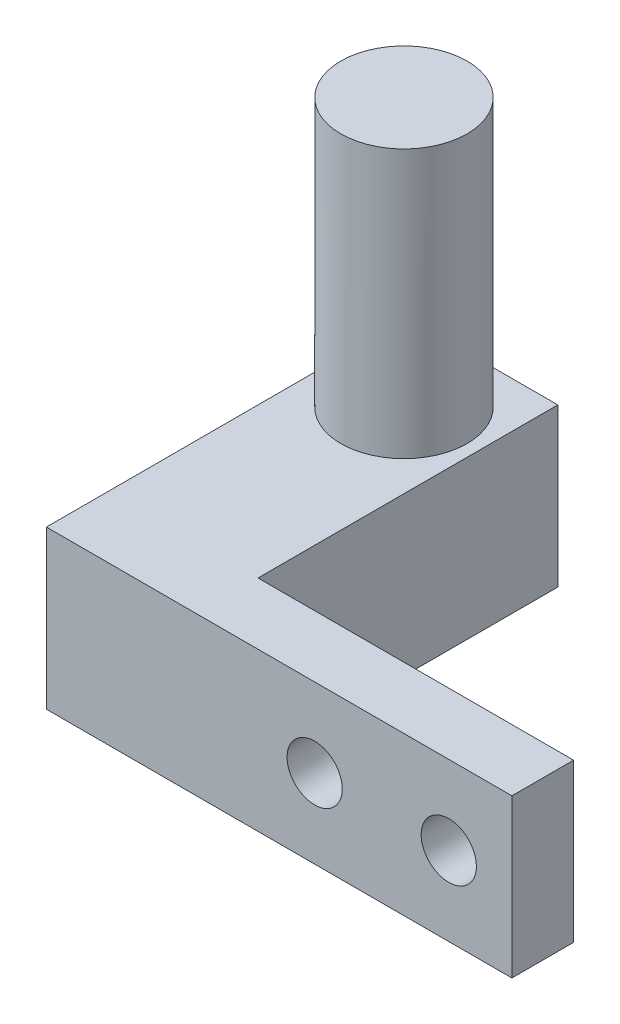
ISO-10303-21;
HEADER;
FILE_DESCRIPTION(('STEP AP214'),'2;1');
FILE_NAME('part.step','',(''),(''),'','','');
FILE_SCHEMA(('AUTOMOTIVE_DESIGN { 1 0 10303 214 1 1 1 1 }'));
ENDSEC;
DATA;
#1=APPLICATION_CONTEXT('core data for automotive mechanical design processes');
#2=APPLICATION_PROTOCOL_DEFINITION('international standard','automotive_design',2000,#1);
#3=PRODUCT_CONTEXT('',#1,'mechanical');
#4=PRODUCT('Part','Part','',(#3));
#5=PRODUCT_RELATED_PRODUCT_CATEGORY('part','',(#4));
#6=PRODUCT_DEFINITION_FORMATION('','',#4);
#7=PRODUCT_DEFINITION_CONTEXT('part definition',#1,'design');
#8=PRODUCT_DEFINITION('design','',#6,#7);
#9=PRODUCT_DEFINITION_SHAPE('','',#8);
#10=(LENGTH_UNIT() NAMED_UNIT(*) SI_UNIT(.MILLI.,.METRE.));
#11=(NAMED_UNIT(*) PLANE_ANGLE_UNIT() SI_UNIT($,.RADIAN.));
#12=(NAMED_UNIT(*) SI_UNIT($,.STERADIAN.) SOLID_ANGLE_UNIT());
#13=UNCERTAINTY_MEASURE_WITH_UNIT(LENGTH_MEASURE(1.E-05),#10,'distance_accuracy_value','');
#14=(GEOMETRIC_REPRESENTATION_CONTEXT(3) GLOBAL_UNCERTAINTY_ASSIGNED_CONTEXT((#13)) GLOBAL_UNIT_ASSIGNED_CONTEXT((#10,
#11,#12)) REPRESENTATION_CONTEXT('',''));
#15=CARTESIAN_POINT('',(0.,0.,0.));
#16=DIRECTION('',(0.,0.,1.));
#17=DIRECTION('',(1.,0.,0.));
#18=AXIS2_PLACEMENT_3D('',#15,#16,#17);
#19=CARTESIAN_POINT('',(8.5,0.,0.));
#20=DIRECTION('',(-1.,0.,0.));
#21=DIRECTION('',(0.,0.,1.));
#22=AXIS2_PLACEMENT_3D('',#19,#20,#21);
#23=PLANE('',#22);
#24=DIRECTION('',(0.,0.,1.));
#25=VECTOR('',#24,1.);
#26=CARTESIAN_POINT('',(8.5,10.,0.));
#27=LINE('',#26,#25);
#28=CARTESIAN_POINT('',(8.5,10.,0.));
#29=VERTEX_POINT('',#28);
#30=CARTESIAN_POINT('',(8.5,10.,19.));
#31=VERTEX_POINT('',#30);
#32=EDGE_CURVE('E126',#29,#31,#27,.T.);
#33=ORIENTED_EDGE('',*,*,#32,.T.);
#34=DIRECTION('',(0.,-1.,0.));
#35=VECTOR('',#34,1.);
#36=CARTESIAN_POINT('',(8.5,27.,19.));
#37=LINE('',#36,#35);
#38=CARTESIAN_POINT('',(8.5,0.,19.));
#39=VERTEX_POINT('',#38);
#40=EDGE_CURVE('E101',#31,#39,#37,.T.);
#41=ORIENTED_EDGE('',*,*,#40,.T.);
#42=DIRECTION('',(0.,0.,1.));
#43=VECTOR('',#42,1.);
#44=CARTESIAN_POINT('',(8.5,0.,0.));
#45=LINE('',#44,#43);
#46=CARTESIAN_POINT('',(8.5,0.,0.));
#47=VERTEX_POINT('',#46);
#48=EDGE_CURVE('E99',#47,#39,#45,.T.);
#49=ORIENTED_EDGE('',*,*,#48,.F.);
#50=DIRECTION('',(0.,1.,0.));
#51=VECTOR('',#50,1.);
#52=CARTESIAN_POINT('',(8.5,0.,0.));
#53=LINE('',#52,#51);
#54=EDGE_CURVE('E128',#47,#29,#53,.T.);
#55=ORIENTED_EDGE('',*,*,#54,.T.);
#56=EDGE_LOOP('',(#33,#41,#49,#55));
#57=FACE_BOUND('',#56,.T.);
#58=ADVANCED_FACE('F33',(#57),#23,.F.);
#59=CARTESIAN_POINT('',(0.,0.,10.));
#60=DIRECTION('',(0.,1.,0.));
#61=DIRECTION('',(0.,0.,1.));
#62=AXIS2_PLACEMENT_3D('',#59,#60,#61);
#63=PLANE('',#62);
#64=ORIENTED_EDGE('',*,*,#48,.T.);
#65=DIRECTION('',(-1.,0.,0.));
#66=VECTOR('',#65,1.);
#67=CARTESIAN_POINT('',(8.5,0.,19.));
#68=LINE('',#67,#66);
#69=CARTESIAN_POINT('',(28.5,0.,19.));
#70=VERTEX_POINT('',#69);
#71=EDGE_CURVE('E89',#70,#39,#68,.T.);
#72=ORIENTED_EDGE('',*,*,#71,.F.);
#73=DIRECTION('',(0.,0.,-1.));
#74=VECTOR('',#73,1.);
#75=CARTESIAN_POINT('',(28.5,0.,22.91));
#76=LINE('',#75,#74);
#77=CARTESIAN_POINT('',(28.5,0.,22.91));
#78=VERTEX_POINT('',#77);
#79=EDGE_CURVE('E96',#78,#70,#76,.T.);
#80=ORIENTED_EDGE('',*,*,#79,.F.);
#81=DIRECTION('',(1.,0.,0.));
#82=VECTOR('',#81,1.);
#83=CARTESIAN_POINT('',(8.5,0.,22.91));
#84=LINE('',#83,#82);
#85=CARTESIAN_POINT('',(-1.,0.,22.91));
#86=VERTEX_POINT('',#85);
#87=EDGE_CURVE('E119',#86,#78,#84,.T.);
#88=ORIENTED_EDGE('',*,*,#87,.F.);
#89=DIRECTION('',(0.,0.,-1.));
#90=VECTOR('',#89,1.);
#91=CARTESIAN_POINT('',(-1.,0.,0.));
#92=LINE('',#91,#90);
#93=CARTESIAN_POINT('',(-1.,0.,0.));
#94=VERTEX_POINT('',#93);
#95=EDGE_CURVE('E121',#86,#94,#92,.T.);
#96=ORIENTED_EDGE('',*,*,#95,.T.);
#97=DIRECTION('',(1.,0.,0.));
#98=VECTOR('',#97,1.);
#99=CARTESIAN_POINT('',(0.,0.,0.));
#100=LINE('',#99,#98);
#101=EDGE_CURVE('E134',#94,#47,#100,.T.);
#102=ORIENTED_EDGE('',*,*,#101,.T.);
#103=EDGE_LOOP('',(#64,#72,#80,#88,#96,#102));
#104=FACE_BOUND('',#103,.T.);
#105=ADVANCED_FACE('F35',(#104),#63,.F.);
#106=CARTESIAN_POINT('',(0.,10.,10.));
#107=DIRECTION('',(0.,-1.,0.));
#108=DIRECTION('',(0.,0.,-1.));
#109=AXIS2_PLACEMENT_3D('',#106,#107,#108);
#110=PLANE('',#109);
#111=CARTESIAN_POINT('',(3.75,10.,5.));
#112=DIRECTION('',(0.,-1.,0.));
#113=DIRECTION('',(0.,0.,-1.));
#114=AXIS2_PLACEMENT_3D('',#111,#112,#113);
#115=CIRCLE('',#114,4.);
#116=CARTESIAN_POINT('',(3.75,10.,0.999999999999998));
#117=VERTEX_POINT('',#116);
#118=EDGE_CURVE('E42',#117,#117,#115,.F.);
#119=ORIENTED_EDGE('',*,*,#118,.F.);
#120=EDGE_LOOP('',(#119));
#121=FACE_BOUND('',#120,.T.);
#122=DIRECTION('',(-1.,0.,0.));
#123=VECTOR('',#122,1.);
#124=CARTESIAN_POINT('',(0.,10.,19.));
#125=LINE('',#124,#123);
#126=CARTESIAN_POINT('',(28.5,10.,19.));
#127=VERTEX_POINT('',#126);
#128=EDGE_CURVE('E49',#127,#31,#125,.T.);
#129=ORIENTED_EDGE('',*,*,#128,.T.);
#130=ORIENTED_EDGE('',*,*,#32,.F.);
#131=DIRECTION('',(-1.,0.,0.));
#132=VECTOR('',#131,1.);
#133=CARTESIAN_POINT('',(0.,10.,0.));
#134=LINE('',#133,#132);
#135=CARTESIAN_POINT('',(-0.999999999999999,10.,0.));
#136=VERTEX_POINT('',#135);
#137=EDGE_CURVE('E136',#29,#136,#134,.T.);
#138=ORIENTED_EDGE('',*,*,#137,.T.);
#139=DIRECTION('',(0.,0.,-1.));
#140=VECTOR('',#139,1.);
#141=CARTESIAN_POINT('',(-1.,10.,0.));
#142=LINE('',#141,#140);
#143=CARTESIAN_POINT('',(-1.,10.,22.91));
#144=VERTEX_POINT('',#143);
#145=EDGE_CURVE('E57',#144,#136,#142,.T.);
#146=ORIENTED_EDGE('',*,*,#145,.F.);
#147=DIRECTION('',(-1.,0.,0.));
#148=VECTOR('',#147,1.);
#149=CARTESIAN_POINT('',(8.5,10.,22.91));
#150=LINE('',#149,#148);
#151=CARTESIAN_POINT('',(28.5,10.,22.91));
#152=VERTEX_POINT('',#151);
#153=EDGE_CURVE('E109',#152,#144,#150,.T.);
#154=ORIENTED_EDGE('',*,*,#153,.F.);
#155=DIRECTION('',(0.,0.,1.));
#156=VECTOR('',#155,1.);
#157=CARTESIAN_POINT('',(28.5,10.,22.91));
#158=LINE('',#157,#156);
#159=EDGE_CURVE('E107',#127,#152,#158,.T.);
#160=ORIENTED_EDGE('',*,*,#159,.F.);
#161=EDGE_LOOP('',(#129,#130,#138,#146,#154,#160));
#162=FACE_BOUND('',#161,.T.);
#163=ADVANCED_FACE('F154',(#121,#162),#110,.F.);
#164=CARTESIAN_POINT('',(0.,0.,0.));
#165=DIRECTION('',(0.,0.,-1.));
#166=DIRECTION('',(-1.,0.,0.));
#167=AXIS2_PLACEMENT_3D('',#164,#165,#166);
#168=PLANE('',#167);
#169=DIRECTION('',(0.,1.,0.));
#170=VECTOR('',#169,1.);
#171=CARTESIAN_POINT('',(-1.,0.,0.));
#172=LINE('',#171,#170);
#173=EDGE_CURVE('E123',#94,#136,#172,.T.);
#174=ORIENTED_EDGE('',*,*,#173,.T.);
#175=ORIENTED_EDGE('',*,*,#137,.F.);
#176=ORIENTED_EDGE('',*,*,#54,.F.);
#177=ORIENTED_EDGE('',*,*,#101,.F.);
#178=EDGE_LOOP('',(#174,#175,#176,#177));
#179=FACE_BOUND('',#178,.T.);
#180=ADVANCED_FACE('F163',(#179),#168,.T.);
#181=CARTESIAN_POINT('',(3.75,27.,5.));
#182=DIRECTION('',(0.,-1.,0.));
#183=DIRECTION('',(0.,0.,-1.));
#184=AXIS2_PLACEMENT_3D('',#181,#182,#183);
#185=CYLINDRICAL_SURFACE('',#184,4.);
#186=CARTESIAN_POINT('',(3.75,27.,5.));
#187=DIRECTION('',(0.,1.,0.));
#188=DIRECTION('',(0.,0.,1.));
#189=AXIS2_PLACEMENT_3D('',#186,#187,#188);
#190=CIRCLE('',#189,4.);
#191=CARTESIAN_POINT('',(3.75,27.,9.));
#192=VERTEX_POINT('',#191);
#193=EDGE_CURVE('E131',#192,#192,#190,.T.);
#194=ORIENTED_EDGE('',*,*,#193,.F.);
#195=EDGE_LOOP('',(#194));
#196=FACE_BOUND('',#195,.T.);
#197=ORIENTED_EDGE('',*,*,#118,.T.);
#198=EDGE_LOOP('',(#197));
#199=FACE_BOUND('',#198,.T.);
#200=ADVANCED_FACE('F176',(#196,#199),#185,.T.);
#201=CARTESIAN_POINT('',(3.75,27.,5.));
#202=DIRECTION('',(0.,1.,0.));
#203=DIRECTION('',(0.,0.,1.));
#204=AXIS2_PLACEMENT_3D('',#201,#202,#203);
#205=PLANE('',#204);
#206=ORIENTED_EDGE('',*,*,#193,.T.);
#207=EDGE_LOOP('',(#206));
#208=FACE_BOUND('',#207,.T.);
#209=ADVANCED_FACE('F173',(#208),#205,.T.);
#210=CARTESIAN_POINT('',(-1.,0.,0.));
#211=DIRECTION('',(1.,0.,0.));
#212=DIRECTION('',(0.,0.,-1.));
#213=AXIS2_PLACEMENT_3D('',#210,#211,#212);
#214=PLANE('',#213);
#215=ORIENTED_EDGE('',*,*,#95,.F.);
#216=DIRECTION('',(0.,-1.,0.));
#217=VECTOR('',#216,1.);
#218=CARTESIAN_POINT('',(-1.,10.,22.91));
#219=LINE('',#218,#217);
#220=EDGE_CURVE('E116',#144,#86,#219,.T.);
#221=ORIENTED_EDGE('',*,*,#220,.F.);
#222=ORIENTED_EDGE('',*,*,#145,.T.);
#223=ORIENTED_EDGE('',*,*,#173,.F.);
#224=EDGE_LOOP('',(#215,#221,#222,#223));
#225=FACE_BOUND('',#224,.T.);
#226=ADVANCED_FACE('F160',(#225),#214,.F.);
#227=CARTESIAN_POINT('',(0.,0.,22.91));
#228=DIRECTION('',(0.,0.,-1.));
#229=DIRECTION('',(-1.,0.,0.));
#230=AXIS2_PLACEMENT_3D('',#227,#228,#229);
#231=PLANE('',#230);
#232=CARTESIAN_POINT('',(24.5,5.,22.91));
#233=DIRECTION('',(0.,0.,1.));
#234=DIRECTION('',(1.,0.,0.));
#235=AXIS2_PLACEMENT_3D('',#232,#233,#234);
#236=CIRCLE('',#235,1.75);
#237=CARTESIAN_POINT('',(26.25,5.,22.91));
#238=VERTEX_POINT('',#237);
#239=EDGE_CURVE('E149',#238,#238,#236,.T.);
#240=ORIENTED_EDGE('',*,*,#239,.F.);
#241=EDGE_LOOP('',(#240));
#242=FACE_BOUND('',#241,.T.);
#243=CARTESIAN_POINT('',(16.,5.,22.91));
#244=DIRECTION('',(0.,0.,1.));
#245=DIRECTION('',(1.,0.,0.));
#246=AXIS2_PLACEMENT_3D('',#243,#244,#245);
#247=CIRCLE('',#246,1.75);
#248=CARTESIAN_POINT('',(17.75,5.,22.91));
#249=VERTEX_POINT('',#248);
#250=EDGE_CURVE('E141',#249,#249,#247,.T.);
#251=ORIENTED_EDGE('',*,*,#250,.F.);
#252=EDGE_LOOP('',(#251));
#253=FACE_BOUND('',#252,.T.);
#254=ORIENTED_EDGE('',*,*,#87,.T.);
#255=DIRECTION('',(0.,-1.,0.));
#256=VECTOR('',#255,1.);
#257=CARTESIAN_POINT('',(28.5,10.,22.91));
#258=LINE('',#257,#256);
#259=EDGE_CURVE('E106',#152,#78,#258,.T.);
#260=ORIENTED_EDGE('',*,*,#259,.F.);
#261=ORIENTED_EDGE('',*,*,#153,.T.);
#262=ORIENTED_EDGE('',*,*,#220,.T.);
#263=EDGE_LOOP('',(#254,#260,#261,#262));
#264=FACE_BOUND('',#263,.T.);
#265=ADVANCED_FACE('F158',(#242,#253,#264),#231,.F.);
#266=CARTESIAN_POINT('',(28.5,0.,0.));
#267=DIRECTION('',(1.,0.,0.));
#268=DIRECTION('',(0.,0.,-1.));
#269=AXIS2_PLACEMENT_3D('',#266,#267,#268);
#270=PLANE('',#269);
#271=DIRECTION('',(0.,-1.,0.));
#272=VECTOR('',#271,1.);
#273=CARTESIAN_POINT('',(28.5,0.,19.));
#274=LINE('',#273,#272);
#275=EDGE_CURVE('E11',#127,#70,#274,.T.);
#276=ORIENTED_EDGE('',*,*,#275,.F.);
#277=ORIENTED_EDGE('',*,*,#159,.T.);
#278=ORIENTED_EDGE('',*,*,#259,.T.);
#279=ORIENTED_EDGE('',*,*,#79,.T.);
#280=EDGE_LOOP('',(#276,#277,#278,#279));
#281=FACE_BOUND('',#280,.T.);
#282=ADVANCED_FACE('F104',(#281),#270,.T.);
#283=CARTESIAN_POINT('',(8.5,27.,19.));
#284=DIRECTION('',(0.,0.,1.));
#285=DIRECTION('',(1.,0.,0.));
#286=AXIS2_PLACEMENT_3D('',#283,#284,#285);
#287=PLANE('',#286);
#288=CARTESIAN_POINT('',(24.5,5.,19.));
#289=DIRECTION('',(0.,0.,1.));
#290=DIRECTION('',(1.,0.,0.));
#291=AXIS2_PLACEMENT_3D('',#288,#289,#290);
#292=CIRCLE('',#291,1.75);
#293=CARTESIAN_POINT('',(26.25,5.,19.));
#294=VERTEX_POINT('',#293);
#295=EDGE_CURVE('E37',#294,#294,#292,.T.);
#296=ORIENTED_EDGE('',*,*,#295,.T.);
#297=EDGE_LOOP('',(#296));
#298=FACE_BOUND('',#297,.T.);
#299=CARTESIAN_POINT('',(16.,5.,19.));
#300=DIRECTION('',(0.,0.,1.));
#301=DIRECTION('',(1.,0.,0.));
#302=AXIS2_PLACEMENT_3D('',#299,#300,#301);
#303=CIRCLE('',#302,1.75);
#304=CARTESIAN_POINT('',(17.75,5.,19.));
#305=VERTEX_POINT('',#304);
#306=EDGE_CURVE('E102',#305,#305,#303,.T.);
#307=ORIENTED_EDGE('',*,*,#306,.T.);
#308=EDGE_LOOP('',(#307));
#309=FACE_BOUND('',#308,.T.);
#310=ORIENTED_EDGE('',*,*,#275,.T.);
#311=ORIENTED_EDGE('',*,*,#71,.T.);
#312=ORIENTED_EDGE('',*,*,#40,.F.);
#313=ORIENTED_EDGE('',*,*,#128,.F.);
#314=EDGE_LOOP('',(#310,#311,#312,#313));
#315=FACE_BOUND('',#314,.T.);
#316=ADVANCED_FACE('F88',(#298,#309,#315),#287,.F.);
#317=CARTESIAN_POINT('',(16.,5.,0.));
#318=DIRECTION('',(0.,0.,1.));
#319=DIRECTION('',(1.,0.,0.));
#320=AXIS2_PLACEMENT_3D('',#317,#318,#319);
#321=CYLINDRICAL_SURFACE('',#320,1.75);
#322=ORIENTED_EDGE('',*,*,#250,.T.);
#323=EDGE_LOOP('',(#322));
#324=FACE_BOUND('',#323,.T.);
#325=ORIENTED_EDGE('',*,*,#306,.F.);
#326=EDGE_LOOP('',(#325));
#327=FACE_BOUND('',#326,.T.);
#328=ADVANCED_FACE('F225',(#324,#327),#321,.F.);
#329=CARTESIAN_POINT('',(24.5,5.,0.));
#330=DIRECTION('',(0.,0.,1.));
#331=DIRECTION('',(1.,0.,0.));
#332=AXIS2_PLACEMENT_3D('',#329,#330,#331);
#333=CYLINDRICAL_SURFACE('',#332,1.75);
#334=ORIENTED_EDGE('',*,*,#239,.T.);
#335=EDGE_LOOP('',(#334));
#336=FACE_BOUND('',#335,.T.);
#337=ORIENTED_EDGE('',*,*,#295,.F.);
#338=EDGE_LOOP('',(#337));
#339=FACE_BOUND('',#338,.T.);
#340=ADVANCED_FACE('F233',(#336,#339),#333,.F.);
#341=CLOSED_SHELL('',(#58,#105,#163,#180,#200,#209,#226,#265,#282,#316,#328,#340));
#342=MANIFOLD_SOLID_BREP('B2',#341);
#343=ADVANCED_BREP_SHAPE_REPRESENTATION('',(#18,#342),#14);
#344=SHAPE_DEFINITION_REPRESENTATION(#9,#343);
ENDSEC;
END-ISO-10303-21;
